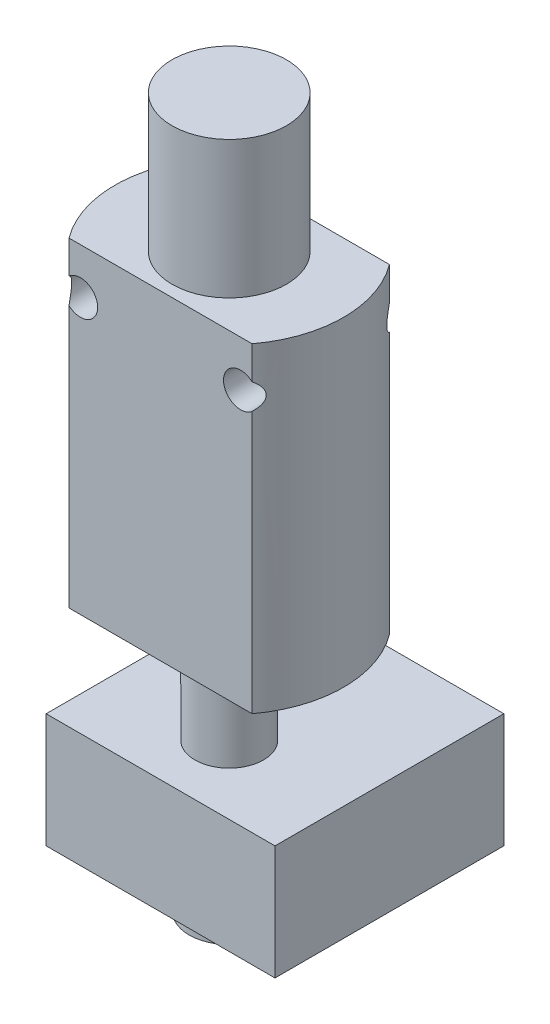
ISO-10303-21;
HEADER;
FILE_DESCRIPTION(('STEP AP214'),'2;1');
FILE_NAME('part.step','',(''),(''),'','','');
FILE_SCHEMA(('AUTOMOTIVE_DESIGN { 1 0 10303 214 1 1 1 1 }'));
ENDSEC;
DATA;
#1=APPLICATION_CONTEXT('core data for automotive mechanical design processes');
#2=APPLICATION_PROTOCOL_DEFINITION('international standard','automotive_design',2000,#1);
#3=PRODUCT_CONTEXT('',#1,'mechanical');
#4=PRODUCT('Part','Part','',(#3));
#5=PRODUCT_RELATED_PRODUCT_CATEGORY('part','',(#4));
#6=PRODUCT_DEFINITION_FORMATION('','',#4);
#7=PRODUCT_DEFINITION_CONTEXT('part definition',#1,'design');
#8=PRODUCT_DEFINITION('design','',#6,#7);
#9=PRODUCT_DEFINITION_SHAPE('','',#8);
#10=(LENGTH_UNIT() NAMED_UNIT(*) SI_UNIT(.MILLI.,.METRE.));
#11=(NAMED_UNIT(*) PLANE_ANGLE_UNIT() SI_UNIT($,.RADIAN.));
#12=(NAMED_UNIT(*) SI_UNIT($,.STERADIAN.) SOLID_ANGLE_UNIT());
#13=UNCERTAINTY_MEASURE_WITH_UNIT(LENGTH_MEASURE(1.E-05),#10,'distance_accuracy_value','');
#14=(GEOMETRIC_REPRESENTATION_CONTEXT(3) GLOBAL_UNCERTAINTY_ASSIGNED_CONTEXT((#13)) GLOBAL_UNIT_ASSIGNED_CONTEXT((#10,
#11,#12)) REPRESENTATION_CONTEXT('',''));
#15=CARTESIAN_POINT('',(0.,0.,0.));
#16=DIRECTION('',(0.,0.,1.));
#17=DIRECTION('',(1.,0.,0.));
#18=AXIS2_PLACEMENT_3D('',#15,#16,#17);
#19=CARTESIAN_POINT('',(-10.,14.,6.));
#20=DIRECTION('',(0.,-1.,0.));
#21=DIRECTION('',(0.,0.,-1.));
#22=AXIS2_PLACEMENT_3D('',#19,#20,#21);
#23=PLANE('',#22);
#24=CARTESIAN_POINT('',(0.,14.,0.));
#25=DIRECTION('',(0.,1.,0.));
#26=DIRECTION('',(0.,0.,1.));
#27=AXIS2_PLACEMENT_3D('',#24,#25,#26);
#28=CIRCLE('',#27,5.);
#29=CARTESIAN_POINT('',(0.,14.,5.));
#30=VERTEX_POINT('',#29);
#31=EDGE_CURVE('E144',#30,#30,#28,.T.);
#32=ORIENTED_EDGE('',*,*,#31,.F.);
#33=EDGE_LOOP('',(#32));
#34=FACE_BOUND('',#33,.T.);
#35=CARTESIAN_POINT('',(0.,14.,0.));
#36=DIRECTION('',(0.,1.,0.));
#37=DIRECTION('',(0.,0.,1.));
#38=AXIS2_PLACEMENT_3D('',#35,#36,#37);
#39=CIRCLE('',#38,9.99999999999999);
#40=CARTESIAN_POINT('',(-7.99999999999999,14.,-6.));
#41=VERTEX_POINT('',#40);
#42=CARTESIAN_POINT('',(-7.99999999999999,14.,6.));
#43=VERTEX_POINT('',#42);
#44=EDGE_CURVE('E121',#41,#43,#39,.T.);
#45=ORIENTED_EDGE('',*,*,#44,.T.);
#46=DIRECTION('',(-1.,0.,0.));
#47=VECTOR('',#46,1.);
#48=CARTESIAN_POINT('',(-10.,14.,6.));
#49=LINE('',#48,#47);
#50=CARTESIAN_POINT('',(7.99999999999999,14.,6.));
#51=VERTEX_POINT('',#50);
#52=EDGE_CURVE('E125',#51,#43,#49,.T.);
#53=ORIENTED_EDGE('',*,*,#52,.F.);
#54=CARTESIAN_POINT('',(0.,14.,0.));
#55=DIRECTION('',(0.,1.,0.));
#56=DIRECTION('',(0.,0.,1.));
#57=AXIS2_PLACEMENT_3D('',#54,#55,#56);
#58=CIRCLE('',#57,9.99999999999999);
#59=CARTESIAN_POINT('',(7.99999999999999,14.,-6.));
#60=VERTEX_POINT('',#59);
#61=EDGE_CURVE('E199',#51,#60,#58,.T.);
#62=ORIENTED_EDGE('',*,*,#61,.T.);
#63=DIRECTION('',(-1.,0.,0.));
#64=VECTOR('',#63,1.);
#65=CARTESIAN_POINT('',(-10.,14.,-6.));
#66=LINE('',#65,#64);
#67=EDGE_CURVE('E127',#60,#41,#66,.T.);
#68=ORIENTED_EDGE('',*,*,#67,.T.);
#69=EDGE_LOOP('',(#45,#53,#62,#68));
#70=FACE_BOUND('',#69,.T.);
#71=ADVANCED_FACE('F33',(#34,#70),#23,.F.);
#72=CARTESIAN_POINT('',(-10.,-14.,6.));
#73=DIRECTION('',(0.,1.,0.));
#74=DIRECTION('',(0.,0.,1.));
#75=AXIS2_PLACEMENT_3D('',#72,#73,#74);
#76=PLANE('',#75);
#77=CARTESIAN_POINT('',(0.,-14.,0.));
#78=DIRECTION('',(0.,1.,0.));
#79=DIRECTION('',(0.,0.,1.));
#80=AXIS2_PLACEMENT_3D('',#77,#78,#79);
#81=CIRCLE('',#80,3.);
#82=CARTESIAN_POINT('',(0.,-14.,3.));
#83=VERTEX_POINT('',#82);
#84=EDGE_CURVE('E223',#83,#83,#81,.T.);
#85=ORIENTED_EDGE('',*,*,#84,.T.);
#86=EDGE_LOOP('',(#85));
#87=FACE_BOUND('',#86,.T.);
#88=DIRECTION('',(1.,0.,0.));
#89=VECTOR('',#88,1.);
#90=CARTESIAN_POINT('',(-10.,-14.,6.));
#91=LINE('',#90,#89);
#92=CARTESIAN_POINT('',(-7.99999999999999,-14.,6.));
#93=VERTEX_POINT('',#92);
#94=CARTESIAN_POINT('',(7.99999999999999,-14.,6.));
#95=VERTEX_POINT('',#94);
#96=EDGE_CURVE('E140',#93,#95,#91,.T.);
#97=ORIENTED_EDGE('',*,*,#96,.F.);
#98=CARTESIAN_POINT('',(0.,-14.,0.));
#99=DIRECTION('',(0.,1.,0.));
#100=DIRECTION('',(0.,0.,1.));
#101=AXIS2_PLACEMENT_3D('',#98,#99,#100);
#102=CIRCLE('',#101,9.99999999999999);
#103=CARTESIAN_POINT('',(-7.99999999999999,-14.,-6.));
#104=VERTEX_POINT('',#103);
#105=EDGE_CURVE('E200',#93,#104,#102,.F.);
#106=ORIENTED_EDGE('',*,*,#105,.T.);
#107=DIRECTION('',(1.,0.,0.));
#108=VECTOR('',#107,1.);
#109=CARTESIAN_POINT('',(-10.,-14.,-6.));
#110=LINE('',#109,#108);
#111=CARTESIAN_POINT('',(7.99999999999999,-14.,-6.));
#112=VERTEX_POINT('',#111);
#113=EDGE_CURVE('E141',#104,#112,#110,.T.);
#114=ORIENTED_EDGE('',*,*,#113,.T.);
#115=CARTESIAN_POINT('',(0.,-14.,0.));
#116=DIRECTION('',(0.,1.,0.));
#117=DIRECTION('',(0.,0.,1.));
#118=AXIS2_PLACEMENT_3D('',#115,#116,#117);
#119=CIRCLE('',#118,9.99999999999999);
#120=EDGE_CURVE('E128',#112,#95,#119,.F.);
#121=ORIENTED_EDGE('',*,*,#120,.T.);
#122=EDGE_LOOP('',(#97,#106,#114,#121));
#123=FACE_BOUND('',#122,.T.);
#124=ADVANCED_FACE('F205',(#87,#123),#76,.F.);
#125=CARTESIAN_POINT('',(-7.,10.,6.));
#126=DIRECTION('',(0.,0.,-1.));
#127=DIRECTION('',(-1.,0.,0.));
#128=AXIS2_PLACEMENT_3D('',#125,#126,#127);
#129=CYLINDRICAL_SURFACE('',#128,1.5);
#130=CARTESIAN_POINT('',(-7.,10.,-6.));
#131=DIRECTION('',(0.,0.,1.));
#132=DIRECTION('',(1.,0.,0.));
#133=AXIS2_PLACEMENT_3D('',#130,#131,#132);
#134=CIRCLE('',#133,1.5);
#135=CARTESIAN_POINT('',(-7.99999999999999,8.8819660112501,-6.));
#136=VERTEX_POINT('',#135);
#137=CARTESIAN_POINT('',(-7.99999999999999,11.1180339887499,-6.));
#138=VERTEX_POINT('',#137);
#139=EDGE_CURVE('E149',#136,#138,#134,.T.);
#140=ORIENTED_EDGE('',*,*,#139,.F.);
#141=CARTESIAN_POINT('',(-7.99999999999999,8.8819660112501,-6.));
#142=CARTESIAN_POINT('',(-8.03319709795339,8.91168999587392,-5.95574757794856));
#143=CARTESIAN_POINT('',(-8.06547382531949,8.94319406453813,-5.91193650763562));
#144=CARTESIAN_POINT('',(-8.12806349588235,9.01024924885044,-5.82558234333872));
#145=CARTESIAN_POINT('',(-8.15836573250745,9.04581994379503,-5.78304674477553));
#146=CARTESIAN_POINT('',(-8.21709784680618,9.12192094350839,-5.6992959478821));
#147=CARTESIAN_POINT('',(-8.24548102185268,9.16253286471241,-5.65812137582313));
#148=CARTESIAN_POINT('',(-8.2991820476017,9.24853986586232,-5.57905460198178));
#149=CARTESIAN_POINT('',(-8.32450671243462,9.29392387521647,-5.54115515917385));
#150=CARTESIAN_POINT('',(-8.36858418886494,9.3842199558626,-5.47432222692192));
#151=CARTESIAN_POINT('',(-8.38776138312471,9.42852544710386,-5.44485872774962));
#152=CARTESIAN_POINT('',(-8.42243915145812,9.52134456248971,-5.39106107623512));
#153=CARTESIAN_POINT('',(-8.43795154621582,9.56984394823762,-5.36671046153633));
#154=CARTESIAN_POINT('',(-8.46460110637092,9.67174421117296,-5.32458104602582));
#155=CARTESIAN_POINT('',(-8.47567021392915,9.72520694015195,-5.30690470094116));
#156=CARTESIAN_POINT('',(-8.49194866496654,9.83520431252895,-5.28081977259772));
#157=CARTESIAN_POINT('',(-8.49716945739679,9.89173272601723,-5.27239308241005));
#158=CARTESIAN_POINT('',(-8.50081944583781,9.99819648261795,-5.26650508032341));
#159=CARTESIAN_POINT('',(-8.50004219971293,10.0480352597205,-5.26776248596406));
#160=CARTESIAN_POINT('',(-8.49363811880348,10.146587853215,-5.27808168264521));
#161=CARTESIAN_POINT('',(-8.48800735531078,10.1953007254282,-5.28714979610468));
#162=CARTESIAN_POINT('',(-8.47127513329529,10.2973459180014,-5.31392281268726));
#163=CARTESIAN_POINT('',(-8.45947758401049,10.3502693365455,-5.33272261032079));
#164=CARTESIAN_POINT('',(-8.43130597602798,10.4518344295103,-5.37715277375631));
#165=CARTESIAN_POINT('',(-8.41492382133668,10.5004683273753,-5.40279521929137));
#166=CARTESIAN_POINT('',(-8.36861987041464,10.6187450069766,-5.47438161937196));
#167=CARTESIAN_POINT('',(-8.33619690891963,10.6853035208725,-5.52375215997205));
#168=CARTESIAN_POINT('',(-8.26517248972191,10.8089780262943,-5.62947761030729));
#169=CARTESIAN_POINT('',(-8.22655015352859,10.8660607343773,-5.6858559711276));
#170=CARTESIAN_POINT('',(-8.15666561018673,10.9562121489143,-5.78544215884129));
#171=CARTESIAN_POINT('',(-8.12660113188093,10.9913924316923,-5.82761873016638));
#172=CARTESIAN_POINT('',(-8.06464717168066,11.0576149614166,-5.91305749310683));
#173=CARTESIAN_POINT('',(-8.0327762062478,11.0886910901623,-5.95630676548155));
#174=CARTESIAN_POINT('',(-8.,11.1180339887499,-6.));
#175=B_SPLINE_CURVE_WITH_KNOTS('',3,(#141,#142,#143,#144,#145,#146,#147,#148,#149,#150,#151,
#152,#153,#154,#155,#156,#157,#158,#159,#160,#161,#162,#163,#164,#165,#166,#167,#168,#169,#170,
#171,#172,#173,#174),.UNSPECIFIED.,.F.,.F.,(4,2,2,2,2,2,2,2,2,2,2,2,2,2,2,2,4),(0.,
0.188433784760338,0.377816388273991,0.570809072083472,0.76336352449458,0.932633231778437,
1.10134927478578,1.27255905579028,1.44343307910128,1.59212863584515,1.7409446682314,
1.9121689192985,2.08369746568321,2.34918211584102,2.6155803962468,2.80325566076793,
2.98926916684157),.UNSPECIFIED.);
#176=EDGE_CURVE('E40',#136,#138,#175,.T.);
#177=ORIENTED_EDGE('',*,*,#176,.T.);
#178=EDGE_LOOP('',(#140,#177));
#179=FACE_BOUND('',#178,.T.);
#180=CARTESIAN_POINT('',(-7.,10.,6.));
#181=DIRECTION('',(0.,0.,1.));
#182=DIRECTION('',(1.,0.,0.));
#183=AXIS2_PLACEMENT_3D('',#180,#181,#182);
#184=CIRCLE('',#183,1.5);
#185=CARTESIAN_POINT('',(-7.99999999999999,8.8819660112501,6.));
#186=VERTEX_POINT('',#185);
#187=CARTESIAN_POINT('',(-7.99999999999999,11.1180339887499,6.));
#188=VERTEX_POINT('',#187);
#189=EDGE_CURVE('E152',#186,#188,#184,.T.);
#190=ORIENTED_EDGE('',*,*,#189,.T.);
#191=CARTESIAN_POINT('',(-7.99999999999999,11.1180339887499,6.));
#192=CARTESIAN_POINT('',(-8.03319709795339,11.0883100041261,5.95574757794856));
#193=CARTESIAN_POINT('',(-8.06547382531949,11.0568059354619,5.91193650763562));
#194=CARTESIAN_POINT('',(-8.12806349588235,10.9897507511496,5.82558234333872));
#195=CARTESIAN_POINT('',(-8.15836573250745,10.954180056205,5.78304674477553));
#196=CARTESIAN_POINT('',(-8.21709784680617,10.8780790564916,5.6992959478821));
#197=CARTESIAN_POINT('',(-8.24548102185268,10.8374671352876,5.65812137582313));
#198=CARTESIAN_POINT('',(-8.2991820476017,10.7514601341377,5.57905460198178));
#199=CARTESIAN_POINT('',(-8.32450671243462,10.7060761247835,5.54115515917385));
#200=CARTESIAN_POINT('',(-8.36858418886494,10.6157800441374,5.47432222692192));
#201=CARTESIAN_POINT('',(-8.38776138312471,10.5714745528961,5.44485872774962));
#202=CARTESIAN_POINT('',(-8.42243915145812,10.4786554375103,5.39106107623512));
#203=CARTESIAN_POINT('',(-8.43795154621582,10.4301560517624,5.36671046153633));
#204=CARTESIAN_POINT('',(-8.46460110637092,10.328255788827,5.32458104602582));
#205=CARTESIAN_POINT('',(-8.47567021392915,10.274793059848,5.30690470094116));
#206=CARTESIAN_POINT('',(-8.49194866496654,10.164795687471,5.28081977259772));
#207=CARTESIAN_POINT('',(-8.49716945739679,10.1082672739828,5.27239308241005));
#208=CARTESIAN_POINT('',(-8.50081944583781,10.001803517382,5.26650508032341));
#209=CARTESIAN_POINT('',(-8.50004219971293,9.95196474027946,5.26776248596406));
#210=CARTESIAN_POINT('',(-8.49363811880348,9.85341214678495,5.27808168264521));
#211=CARTESIAN_POINT('',(-8.48800735531078,9.80469927457184,5.28714979610468));
#212=CARTESIAN_POINT('',(-8.47127513329529,9.70265408199865,5.31392281268726));
#213=CARTESIAN_POINT('',(-8.45947758401049,9.64973066345448,5.33272261032079));
#214=CARTESIAN_POINT('',(-8.43130597602798,9.54816557048967,5.37715277375631));
#215=CARTESIAN_POINT('',(-8.41492382133668,9.49953167262469,5.40279521929137));
#216=CARTESIAN_POINT('',(-8.36861987041464,9.38125499302338,5.47438161937196));
#217=CARTESIAN_POINT('',(-8.33619690891963,9.31469647912746,5.52375215997205));
#218=CARTESIAN_POINT('',(-8.26517248972191,9.1910219737057,5.62947761030729));
#219=CARTESIAN_POINT('',(-8.22655015352859,9.13393926562267,5.6858559711276));
#220=CARTESIAN_POINT('',(-8.15666561018673,9.04378785108572,5.78544215884129));
#221=CARTESIAN_POINT('',(-8.12660113188093,9.00860756830766,5.82761873016638));
#222=CARTESIAN_POINT('',(-8.06464717168066,8.94238503858345,5.91305749310683));
#223=CARTESIAN_POINT('',(-8.0327762062478,8.9113089098377,5.95630676548154));
#224=CARTESIAN_POINT('',(-8.,8.8819660112501,6.));
#225=B_SPLINE_CURVE_WITH_KNOTS('',3,(#191,#192,#193,#194,#195,#196,#197,#198,#199,#200,#201,
#202,#203,#204,#205,#206,#207,#208,#209,#210,#211,#212,#213,#214,#215,#216,#217,#218,#219,#220,
#221,#222,#223,#224),.UNSPECIFIED.,.F.,.F.,(4,2,2,2,2,2,2,2,2,2,2,2,2,2,2,2,4),(0.,
0.188433784760338,0.377816388273991,0.570809072083472,0.76336352449458,0.932633231778437,
1.10134927478578,1.27255905579028,1.44343307910128,1.59212863584515,1.7409446682314,
1.9121689192985,2.08369746568321,2.34918211584102,2.6155803962468,2.80325566076793,
2.98926916684157),.UNSPECIFIED.);
#226=EDGE_CURVE('E132',#188,#186,#225,.T.);
#227=ORIENTED_EDGE('',*,*,#226,.T.);
#228=EDGE_LOOP('',(#190,#227));
#229=FACE_BOUND('',#228,.T.);
#230=ADVANCED_FACE('F201',(#179,#229),#129,.F.);
#231=CARTESIAN_POINT('',(7.,10.,6.));
#232=DIRECTION('',(0.,0.,-1.));
#233=DIRECTION('',(-1.,0.,0.));
#234=AXIS2_PLACEMENT_3D('',#231,#232,#233);
#235=CYLINDRICAL_SURFACE('',#234,1.5);
#236=CARTESIAN_POINT('',(7.,10.,-6.));
#237=DIRECTION('',(0.,0.,1.));
#238=DIRECTION('',(-1.,0.,0.));
#239=AXIS2_PLACEMENT_3D('',#236,#237,#238);
#240=CIRCLE('',#239,1.5);
#241=CARTESIAN_POINT('',(7.99999999999999,11.1180339887499,-6.));
#242=VERTEX_POINT('',#241);
#243=CARTESIAN_POINT('',(7.99999999999999,8.8819660112501,-6.));
#244=VERTEX_POINT('',#243);
#245=EDGE_CURVE('E235',#242,#244,#240,.T.);
#246=ORIENTED_EDGE('',*,*,#245,.F.);
#247=CARTESIAN_POINT('',(7.99999999999999,11.1180339887499,-6.));
#248=CARTESIAN_POINT('',(8.03319709795339,11.0883100041261,-5.95574757794856));
#249=CARTESIAN_POINT('',(8.06547382531949,11.0568059354619,-5.91193650763563));
#250=CARTESIAN_POINT('',(8.12806349588235,10.9897507511496,-5.82558234333872));
#251=CARTESIAN_POINT('',(8.15836573250745,10.954180056205,-5.78304674477553));
#252=CARTESIAN_POINT('',(8.21709784680618,10.8780790564916,-5.69929594788209));
#253=CARTESIAN_POINT('',(8.24548102185268,10.8374671352876,-5.65812137582313));
#254=CARTESIAN_POINT('',(8.2991820476017,10.7514601341377,-5.57905460198178));
#255=CARTESIAN_POINT('',(8.32450671243462,10.7060761247835,-5.54115515917385));
#256=CARTESIAN_POINT('',(8.36858418886494,10.6157800441374,-5.47432222692192));
#257=CARTESIAN_POINT('',(8.38776138312471,10.5714745528961,-5.44485872774962));
#258=CARTESIAN_POINT('',(8.42243915145811,10.4786554375103,-5.39106107623512));
#259=CARTESIAN_POINT('',(8.43795154621582,10.4301560517624,-5.36671046153633));
#260=CARTESIAN_POINT('',(8.46460110637092,10.328255788827,-5.32458104602582));
#261=CARTESIAN_POINT('',(8.47567021392915,10.274793059848,-5.30690470094116));
#262=CARTESIAN_POINT('',(8.49194866496654,10.164795687471,-5.28081977259772));
#263=CARTESIAN_POINT('',(8.49716945739679,10.1082672739828,-5.27239308241005));
#264=CARTESIAN_POINT('',(8.50081944583781,10.001803517382,-5.26650508032341));
#265=CARTESIAN_POINT('',(8.50004219971293,9.95196474027946,-5.26776248596406));
#266=CARTESIAN_POINT('',(8.49363811880348,9.85341214678495,-5.27808168264521));
#267=CARTESIAN_POINT('',(8.48800735531078,9.80469927457184,-5.28714979610468));
#268=CARTESIAN_POINT('',(8.47127513329529,9.70265408199865,-5.31392281268726));
#269=CARTESIAN_POINT('',(8.45947758401049,9.64973066345448,-5.33272261032079));
#270=CARTESIAN_POINT('',(8.43130597602798,9.54816557048968,-5.37715277375631));
#271=CARTESIAN_POINT('',(8.41492382133668,9.49953167262469,-5.40279521929137));
#272=CARTESIAN_POINT('',(8.36861987041464,9.38125499302338,-5.47438161937196));
#273=CARTESIAN_POINT('',(8.33619690891963,9.31469647912746,-5.52375215997205));
#274=CARTESIAN_POINT('',(8.26517248972191,9.1910219737057,-5.62947761030729));
#275=CARTESIAN_POINT('',(8.22655015352859,9.13393926562267,-5.6858559711276));
#276=CARTESIAN_POINT('',(8.15666561018673,9.04378785108572,-5.78544215884129));
#277=CARTESIAN_POINT('',(8.12660113188092,9.00860756830766,-5.82761873016638));
#278=CARTESIAN_POINT('',(8.06464717168066,8.94238503858345,-5.91305749310683));
#279=CARTESIAN_POINT('',(8.03277620624779,8.9113089098377,-5.95630676548155));
#280=CARTESIAN_POINT('',(7.99999999999999,8.8819660112501,-6.));
#281=B_SPLINE_CURVE_WITH_KNOTS('',3,(#247,#248,#249,#250,#251,#252,#253,#254,#255,#256,#257,
#258,#259,#260,#261,#262,#263,#264,#265,#266,#267,#268,#269,#270,#271,#272,#273,#274,#275,#276,
#277,#278,#279,#280),.UNSPECIFIED.,.F.,.F.,(4,2,2,2,2,2,2,2,2,2,2,2,2,2,2,2,4),(0.,
0.188433784760337,0.377816388273991,0.570809072083475,0.763363524494579,0.932633231778435,
1.10134927478578,1.27255905579028,1.44343307910128,1.59212863584514,1.7409446682314,
1.91216891929849,2.08369746568321,2.34918211584102,2.6155803962468,2.80325566076793,
2.98926916684157),.UNSPECIFIED.);
#282=EDGE_CURVE('E157',#242,#244,#281,.T.);
#283=ORIENTED_EDGE('',*,*,#282,.T.);
#284=EDGE_LOOP('',(#246,#283));
#285=FACE_BOUND('',#284,.T.);
#286=CARTESIAN_POINT('',(7.,10.,6.));
#287=DIRECTION('',(0.,0.,1.));
#288=DIRECTION('',(-1.,0.,0.));
#289=AXIS2_PLACEMENT_3D('',#286,#287,#288);
#290=CIRCLE('',#289,1.5);
#291=CARTESIAN_POINT('',(7.99999999999999,11.1180339887499,6.));
#292=VERTEX_POINT('',#291);
#293=CARTESIAN_POINT('',(7.99999999999999,8.8819660112501,6.));
#294=VERTEX_POINT('',#293);
#295=EDGE_CURVE('E233',#292,#294,#290,.T.);
#296=ORIENTED_EDGE('',*,*,#295,.T.);
#297=CARTESIAN_POINT('',(7.99999999999999,8.8819660112501,6.));
#298=CARTESIAN_POINT('',(8.03319709795339,8.91168999587392,5.95574757794856));
#299=CARTESIAN_POINT('',(8.06547382531949,8.94319406453813,5.91193650763563));
#300=CARTESIAN_POINT('',(8.12806349588235,9.01024924885044,5.82558234333872));
#301=CARTESIAN_POINT('',(8.15836573250745,9.04581994379503,5.78304674477553));
#302=CARTESIAN_POINT('',(8.21709784680618,9.12192094350839,5.69929594788209));
#303=CARTESIAN_POINT('',(8.24548102185268,9.16253286471241,5.65812137582313));
#304=CARTESIAN_POINT('',(8.2991820476017,9.24853986586232,5.57905460198178));
#305=CARTESIAN_POINT('',(8.32450671243462,9.29392387521647,5.54115515917385));
#306=CARTESIAN_POINT('',(8.36858418886494,9.3842199558626,5.47432222692192));
#307=CARTESIAN_POINT('',(8.38776138312471,9.42852544710387,5.44485872774962));
#308=CARTESIAN_POINT('',(8.42243915145811,9.52134456248971,5.39106107623512));
#309=CARTESIAN_POINT('',(8.43795154621582,9.56984394823762,5.36671046153633));
#310=CARTESIAN_POINT('',(8.46460110637092,9.67174421117296,5.32458104602582));
#311=CARTESIAN_POINT('',(8.47567021392915,9.72520694015195,5.30690470094116));
#312=CARTESIAN_POINT('',(8.49194866496654,9.83520431252895,5.28081977259772));
#313=CARTESIAN_POINT('',(8.49716945739679,9.89173272601723,5.27239308241005));
#314=CARTESIAN_POINT('',(8.50081944583781,9.99819648261795,5.26650508032341));
#315=CARTESIAN_POINT('',(8.50004219971293,10.0480352597205,5.26776248596406));
#316=CARTESIAN_POINT('',(8.49363811880348,10.146587853215,5.27808168264521));
#317=CARTESIAN_POINT('',(8.48800735531078,10.1953007254282,5.28714979610468));
#318=CARTESIAN_POINT('',(8.47127513329529,10.2973459180014,5.31392281268726));
#319=CARTESIAN_POINT('',(8.45947758401049,10.3502693365455,5.33272261032079));
#320=CARTESIAN_POINT('',(8.43130597602798,10.4518344295103,5.37715277375631));
#321=CARTESIAN_POINT('',(8.41492382133668,10.5004683273753,5.40279521929137));
#322=CARTESIAN_POINT('',(8.36861987041464,10.6187450069766,5.47438161937196));
#323=CARTESIAN_POINT('',(8.33619690891963,10.6853035208725,5.52375215997205));
#324=CARTESIAN_POINT('',(8.26517248972191,10.8089780262943,5.62947761030729));
#325=CARTESIAN_POINT('',(8.22655015352859,10.8660607343773,5.6858559711276));
#326=CARTESIAN_POINT('',(8.15666561018673,10.9562121489143,5.78544215884129));
#327=CARTESIAN_POINT('',(8.12660113188092,10.9913924316923,5.82761873016639));
#328=CARTESIAN_POINT('',(8.06464717168066,11.0576149614166,5.91305749310683));
#329=CARTESIAN_POINT('',(8.03277620624779,11.0886910901623,5.95630676548155));
#330=CARTESIAN_POINT('',(7.99999999999999,11.1180339887499,6.));
#331=B_SPLINE_CURVE_WITH_KNOTS('',3,(#297,#298,#299,#300,#301,#302,#303,#304,#305,#306,#307,
#308,#309,#310,#311,#312,#313,#314,#315,#316,#317,#318,#319,#320,#321,#322,#323,#324,#325,#326,
#327,#328,#329,#330),.UNSPECIFIED.,.F.,.F.,(4,2,2,2,2,2,2,2,2,2,2,2,2,2,2,2,4),(0.,
0.188433784760337,0.377816388273991,0.570809072083475,0.763363524494579,0.932633231778435,
1.10134927478578,1.27255905579028,1.44343307910128,1.59212863584514,1.7409446682314,
1.91216891929849,2.0836974656832,2.34918211584102,2.6155803962468,2.80325566076794,
2.98926916684157),.UNSPECIFIED.);
#332=EDGE_CURVE('E183',#294,#292,#331,.T.);
#333=ORIENTED_EDGE('',*,*,#332,.T.);
#334=EDGE_LOOP('',(#296,#333));
#335=FACE_BOUND('',#334,.T.);
#336=ADVANCED_FACE('F170',(#285,#335),#235,.F.);
#337=CARTESIAN_POINT('',(0.,0.,6.));
#338=DIRECTION('',(0.,0.,1.));
#339=DIRECTION('',(1.,0.,0.));
#340=AXIS2_PLACEMENT_3D('',#337,#338,#339);
#341=PLANE('',#340);
#342=ORIENTED_EDGE('',*,*,#52,.T.);
#343=DIRECTION('',(0.,1.,0.));
#344=VECTOR('',#343,1.);
#345=CARTESIAN_POINT('',(-7.99999999999999,-20.3245553203368,6.));
#346=LINE('',#345,#344);
#347=EDGE_CURVE('E11',#43,#188,#346,.F.);
#348=ORIENTED_EDGE('',*,*,#347,.T.);
#349=ORIENTED_EDGE('',*,*,#189,.F.);
#350=DIRECTION('',(0.,1.,0.));
#351=VECTOR('',#350,1.);
#352=CARTESIAN_POINT('',(-7.99999999999999,-20.3245553203368,6.));
#353=LINE('',#352,#351);
#354=EDGE_CURVE('E191',#93,#186,#353,.T.);
#355=ORIENTED_EDGE('',*,*,#354,.F.);
#356=ORIENTED_EDGE('',*,*,#96,.T.);
#357=DIRECTION('',(0.,1.,0.));
#358=VECTOR('',#357,1.);
#359=CARTESIAN_POINT('',(7.99999999999999,-20.3245553203368,6.));
#360=LINE('',#359,#358);
#361=EDGE_CURVE('E192',#95,#294,#360,.T.);
#362=ORIENTED_EDGE('',*,*,#361,.T.);
#363=ORIENTED_EDGE('',*,*,#295,.F.);
#364=EDGE_CURVE('E139',#292,#51,#360,.T.);
#365=ORIENTED_EDGE('',*,*,#364,.T.);
#366=EDGE_LOOP('',(#342,#348,#349,#355,#356,#362,#363,#365));
#367=FACE_BOUND('',#366,.T.);
#368=ADVANCED_FACE('F137',(#367),#341,.T.);
#369=CARTESIAN_POINT('',(0.,0.,-6.));
#370=DIRECTION('',(0.,0.,1.));
#371=DIRECTION('',(1.,0.,0.));
#372=AXIS2_PLACEMENT_3D('',#369,#370,#371);
#373=PLANE('',#372);
#374=DIRECTION('',(0.,1.,0.));
#375=VECTOR('',#374,1.);
#376=CARTESIAN_POINT('',(-7.99999999999999,-20.3245553203368,-6.));
#377=LINE('',#376,#375);
#378=EDGE_CURVE('E47',#138,#41,#377,.T.);
#379=ORIENTED_EDGE('',*,*,#378,.T.);
#380=ORIENTED_EDGE('',*,*,#67,.F.);
#381=DIRECTION('',(0.,1.,0.));
#382=VECTOR('',#381,1.);
#383=CARTESIAN_POINT('',(7.99999999999999,-20.3245553203368,-6.));
#384=LINE('',#383,#382);
#385=EDGE_CURVE('E287',#242,#60,#384,.T.);
#386=ORIENTED_EDGE('',*,*,#385,.F.);
#387=ORIENTED_EDGE('',*,*,#245,.T.);
#388=EDGE_CURVE('E55',#112,#244,#384,.T.);
#389=ORIENTED_EDGE('',*,*,#388,.F.);
#390=ORIENTED_EDGE('',*,*,#113,.F.);
#391=EDGE_CURVE('E290',#104,#136,#377,.T.);
#392=ORIENTED_EDGE('',*,*,#391,.T.);
#393=ORIENTED_EDGE('',*,*,#139,.T.);
#394=EDGE_LOOP('',(#379,#380,#386,#387,#389,#390,#392,#393));
#395=FACE_BOUND('',#394,.T.);
#396=ADVANCED_FACE('F210',(#395),#373,.F.);
#397=CARTESIAN_POINT('',(0.,0.,0.));
#398=DIRECTION('',(0.,1.,0.));
#399=DIRECTION('',(0.,0.,1.));
#400=AXIS2_PLACEMENT_3D('',#397,#398,#399);
#401=CYLINDRICAL_SURFACE('',#400,3.);
#402=ORIENTED_EDGE('',*,*,#84,.F.);
#403=EDGE_LOOP('',(#402));
#404=FACE_BOUND('',#403,.T.);
#405=CARTESIAN_POINT('',(0.,-23.,0.));
#406=DIRECTION('',(0.,-1.,0.));
#407=DIRECTION('',(0.,0.,-1.));
#408=AXIS2_PLACEMENT_3D('',#405,#406,#407);
#409=CIRCLE('',#408,3.);
#410=CARTESIAN_POINT('',(0.,-23.,-3.));
#411=VERTEX_POINT('',#410);
#412=EDGE_CURVE('E154',#411,#411,#409,.T.);
#413=ORIENTED_EDGE('',*,*,#412,.F.);
#414=EDGE_LOOP('',(#413));
#415=FACE_BOUND('',#414,.T.);
#416=ADVANCED_FACE('F212',(#404,#415),#401,.T.);
#417=CARTESIAN_POINT('',(0.,26.,0.));
#418=DIRECTION('',(0.,-1.,0.));
#419=DIRECTION('',(0.,0.,-1.));
#420=AXIS2_PLACEMENT_3D('',#417,#418,#419);
#421=PLANE('',#420);
#422=CARTESIAN_POINT('',(0.,26.,0.));
#423=DIRECTION('',(0.,1.,0.));
#424=DIRECTION('',(0.,0.,1.));
#425=AXIS2_PLACEMENT_3D('',#422,#423,#424);
#426=CIRCLE('',#425,5.);
#427=CARTESIAN_POINT('',(0.,26.,5.));
#428=VERTEX_POINT('',#427);
#429=EDGE_CURVE('E249',#428,#428,#426,.T.);
#430=ORIENTED_EDGE('',*,*,#429,.T.);
#431=EDGE_LOOP('',(#430));
#432=FACE_BOUND('',#431,.T.);
#433=ADVANCED_FACE('F317',(#432),#421,.F.);
#434=CARTESIAN_POINT('',(0.,0.,0.));
#435=DIRECTION('',(0.,1.,0.));
#436=DIRECTION('',(0.,0.,1.));
#437=AXIS2_PLACEMENT_3D('',#434,#435,#436);
#438=CYLINDRICAL_SURFACE('',#437,5.);
#439=ORIENTED_EDGE('',*,*,#429,.F.);
#440=EDGE_LOOP('',(#439));
#441=FACE_BOUND('',#440,.T.);
#442=ORIENTED_EDGE('',*,*,#31,.T.);
#443=EDGE_LOOP('',(#442));
#444=FACE_BOUND('',#443,.T.);
#445=ADVANCED_FACE('F327',(#441,#444),#438,.T.);
#446=CARTESIAN_POINT('',(-10.,-23.,0.));
#447=DIRECTION('',(-1.,0.,0.));
#448=DIRECTION('',(0.,0.,1.));
#449=AXIS2_PLACEMENT_3D('',#446,#447,#448);
#450=PLANE('',#449);
#451=DIRECTION('',(0.,0.,-1.));
#452=VECTOR('',#451,1.);
#453=CARTESIAN_POINT('',(-10.,-33.,0.));
#454=LINE('',#453,#452);
#455=CARTESIAN_POINT('',(-10.,-33.,6.));
#456=VERTEX_POINT('',#455);
#457=CARTESIAN_POINT('',(-10.,-33.,-14.));
#458=VERTEX_POINT('',#457);
#459=EDGE_CURVE('E273',#456,#458,#454,.T.);
#460=ORIENTED_EDGE('',*,*,#459,.F.);
#461=DIRECTION('',(0.,-1.,0.));
#462=VECTOR('',#461,1.);
#463=CARTESIAN_POINT('',(-10.,-23.,6.));
#464=LINE('',#463,#462);
#465=CARTESIAN_POINT('',(-10.,-23.,6.));
#466=VERTEX_POINT('',#465);
#467=EDGE_CURVE('E252',#466,#456,#464,.T.);
#468=ORIENTED_EDGE('',*,*,#467,.F.);
#469=DIRECTION('',(0.,0.,-1.));
#470=VECTOR('',#469,1.);
#471=CARTESIAN_POINT('',(-10.,-23.,0.));
#472=LINE('',#471,#470);
#473=CARTESIAN_POINT('',(-10.,-23.,-14.));
#474=VERTEX_POINT('',#473);
#475=EDGE_CURVE('E266',#466,#474,#472,.T.);
#476=ORIENTED_EDGE('',*,*,#475,.T.);
#477=DIRECTION('',(0.,-1.,0.));
#478=VECTOR('',#477,1.);
#479=CARTESIAN_POINT('',(-10.,-23.,-14.));
#480=LINE('',#479,#478);
#481=EDGE_CURVE('E255',#474,#458,#480,.T.);
#482=ORIENTED_EDGE('',*,*,#481,.T.);
#483=EDGE_LOOP('',(#460,#468,#476,#482));
#484=FACE_BOUND('',#483,.T.);
#485=ADVANCED_FACE('F335',(#484),#450,.T.);
#486=CARTESIAN_POINT('',(3.,-23.,6.));
#487=DIRECTION('',(0.,0.,1.));
#488=DIRECTION('',(1.,0.,0.));
#489=AXIS2_PLACEMENT_3D('',#486,#487,#488);
#490=PLANE('',#489);
#491=DIRECTION('',(-1.,0.,0.));
#492=VECTOR('',#491,1.);
#493=CARTESIAN_POINT('',(3.,-33.,6.));
#494=LINE('',#493,#492);
#495=CARTESIAN_POINT('',(10.,-33.,6.));
#496=VERTEX_POINT('',#495);
#497=EDGE_CURVE('E263',#496,#456,#494,.T.);
#498=ORIENTED_EDGE('',*,*,#497,.F.);
#499=DIRECTION('',(0.,-1.,0.));
#500=VECTOR('',#499,1.);
#501=CARTESIAN_POINT('',(10.,-23.,6.));
#502=LINE('',#501,#500);
#503=CARTESIAN_POINT('',(10.,-23.,6.));
#504=VERTEX_POINT('',#503);
#505=EDGE_CURVE('E260',#504,#496,#502,.T.);
#506=ORIENTED_EDGE('',*,*,#505,.F.);
#507=DIRECTION('',(-1.,0.,0.));
#508=VECTOR('',#507,1.);
#509=CARTESIAN_POINT('',(3.,-23.,6.));
#510=LINE('',#509,#508);
#511=EDGE_CURVE('E258',#504,#466,#510,.T.);
#512=ORIENTED_EDGE('',*,*,#511,.T.);
#513=ORIENTED_EDGE('',*,*,#467,.T.);
#514=EDGE_LOOP('',(#498,#506,#512,#513));
#515=FACE_BOUND('',#514,.T.);
#516=ADVANCED_FACE('F342',(#515),#490,.T.);
#517=CARTESIAN_POINT('',(10.,-23.,0.));
#518=DIRECTION('',(1.,0.,0.));
#519=DIRECTION('',(0.,0.,-1.));
#520=AXIS2_PLACEMENT_3D('',#517,#518,#519);
#521=PLANE('',#520);
#522=DIRECTION('',(0.,0.,1.));
#523=VECTOR('',#522,1.);
#524=CARTESIAN_POINT('',(10.,-33.,0.));
#525=LINE('',#524,#523);
#526=CARTESIAN_POINT('',(10.,-33.,-14.));
#527=VERTEX_POINT('',#526);
#528=EDGE_CURVE('E267',#527,#496,#525,.T.);
#529=ORIENTED_EDGE('',*,*,#528,.F.);
#530=DIRECTION('',(0.,-1.,0.));
#531=VECTOR('',#530,1.);
#532=CARTESIAN_POINT('',(10.,-23.,-14.));
#533=LINE('',#532,#531);
#534=CARTESIAN_POINT('',(10.,-23.,-14.));
#535=VERTEX_POINT('',#534);
#536=EDGE_CURVE('E257',#535,#527,#533,.T.);
#537=ORIENTED_EDGE('',*,*,#536,.F.);
#538=DIRECTION('',(0.,0.,1.));
#539=VECTOR('',#538,1.);
#540=CARTESIAN_POINT('',(10.,-23.,0.));
#541=LINE('',#540,#539);
#542=EDGE_CURVE('E278',#535,#504,#541,.T.);
#543=ORIENTED_EDGE('',*,*,#542,.T.);
#544=ORIENTED_EDGE('',*,*,#505,.T.);
#545=EDGE_LOOP('',(#529,#537,#543,#544));
#546=FACE_BOUND('',#545,.T.);
#547=ADVANCED_FACE('F350',(#546),#521,.T.);
#548=CARTESIAN_POINT('',(3.,-23.,-14.));
#549=DIRECTION('',(0.,0.,-1.));
#550=DIRECTION('',(-1.,0.,0.));
#551=AXIS2_PLACEMENT_3D('',#548,#549,#550);
#552=PLANE('',#551);
#553=DIRECTION('',(1.,0.,0.));
#554=VECTOR('',#553,1.);
#555=CARTESIAN_POINT('',(3.,-33.,-14.));
#556=LINE('',#555,#554);
#557=EDGE_CURVE('E270',#458,#527,#556,.T.);
#558=ORIENTED_EDGE('',*,*,#557,.F.);
#559=ORIENTED_EDGE('',*,*,#481,.F.);
#560=DIRECTION('',(1.,0.,0.));
#561=VECTOR('',#560,1.);
#562=CARTESIAN_POINT('',(3.,-23.,-14.));
#563=LINE('',#562,#561);
#564=EDGE_CURVE('E281',#474,#535,#563,.T.);
#565=ORIENTED_EDGE('',*,*,#564,.T.);
#566=ORIENTED_EDGE('',*,*,#536,.T.);
#567=EDGE_LOOP('',(#558,#559,#565,#566));
#568=FACE_BOUND('',#567,.T.);
#569=ADVANCED_FACE('F358',(#568),#552,.T.);
#570=CARTESIAN_POINT('',(0.,-23.,0.));
#571=DIRECTION('',(0.,-1.,0.));
#572=DIRECTION('',(0.,0.,-1.));
#573=AXIS2_PLACEMENT_3D('',#570,#571,#572);
#574=PLANE('',#573);
#575=ORIENTED_EDGE('',*,*,#412,.T.);
#576=EDGE_LOOP('',(#575));
#577=FACE_BOUND('',#576,.T.);
#578=ORIENTED_EDGE('',*,*,#475,.F.);
#579=ORIENTED_EDGE('',*,*,#511,.F.);
#580=ORIENTED_EDGE('',*,*,#542,.F.);
#581=ORIENTED_EDGE('',*,*,#564,.F.);
#582=EDGE_LOOP('',(#578,#579,#580,#581));
#583=FACE_BOUND('',#582,.T.);
#584=ADVANCED_FACE('F179',(#577,#583),#574,.F.);
#585=CARTESIAN_POINT('',(0.,-33.,0.));
#586=DIRECTION('',(0.,-1.,0.));
#587=DIRECTION('',(0.,0.,-1.));
#588=AXIS2_PLACEMENT_3D('',#585,#586,#587);
#589=PLANE('',#588);
#590=CARTESIAN_POINT('',(0.,-33.,0.));
#591=DIRECTION('',(0.,1.,0.));
#592=DIRECTION('',(0.,0.,1.));
#593=AXIS2_PLACEMENT_3D('',#590,#591,#592);
#594=CIRCLE('',#593,3.5);
#595=CARTESIAN_POINT('',(0.,-33.,3.5));
#596=VERTEX_POINT('',#595);
#597=EDGE_CURVE('E245',#596,#596,#594,.T.);
#598=ORIENTED_EDGE('',*,*,#597,.T.);
#599=EDGE_LOOP('',(#598));
#600=FACE_BOUND('',#599,.T.);
#601=ORIENTED_EDGE('',*,*,#459,.T.);
#602=ORIENTED_EDGE('',*,*,#557,.T.);
#603=ORIENTED_EDGE('',*,*,#528,.T.);
#604=ORIENTED_EDGE('',*,*,#497,.T.);
#605=EDGE_LOOP('',(#601,#602,#603,#604));
#606=FACE_BOUND('',#605,.T.);
#607=ADVANCED_FACE('F373',(#600,#606),#589,.T.);
#608=CARTESIAN_POINT('',(0.750000000000005,-38.,0.));
#609=DIRECTION('',(0.,1.,0.));
#610=DIRECTION('',(0.,0.,1.));
#611=AXIS2_PLACEMENT_3D('',#608,#609,#610);
#612=PLANE('',#611);
#613=CARTESIAN_POINT('',(0.,-38.,0.));
#614=DIRECTION('',(0.,1.,0.));
#615=DIRECTION('',(0.,0.,1.));
#616=AXIS2_PLACEMENT_3D('',#613,#614,#615);
#617=CIRCLE('',#616,0.750000000000005);
#618=CARTESIAN_POINT('',(0.,-38.,0.750000000000005));
#619=VERTEX_POINT('',#618);
#620=EDGE_CURVE('E238',#619,#619,#617,.T.);
#621=ORIENTED_EDGE('',*,*,#620,.F.);
#622=EDGE_LOOP('',(#621));
#623=FACE_BOUND('',#622,.T.);
#624=ADVANCED_FACE('F380',(#623),#612,.F.);
#625=CARTESIAN_POINT('',(0.,-38.,0.));
#626=DIRECTION('',(0.,1.,0.));
#627=DIRECTION('',(0.,0.,1.));
#628=AXIS2_PLACEMENT_3D('',#625,#626,#627);
#629=CONICAL_SURFACE('',#628,0.750000000000005,0.942000040379465);
#630=CARTESIAN_POINT('',(0.,-36.,0.));
#631=DIRECTION('',(0.,1.,0.));
#632=DIRECTION('',(0.,0.,1.));
#633=AXIS2_PLACEMENT_3D('',#630,#631,#632);
#634=CIRCLE('',#633,3.5);
#635=CARTESIAN_POINT('',(0.,-36.,3.5));
#636=VERTEX_POINT('',#635);
#637=EDGE_CURVE('E242',#636,#636,#634,.T.);
#638=ORIENTED_EDGE('',*,*,#637,.F.);
#639=EDGE_LOOP('',(#638));
#640=FACE_BOUND('',#639,.T.);
#641=ORIENTED_EDGE('',*,*,#620,.T.);
#642=EDGE_LOOP('',(#641));
#643=FACE_BOUND('',#642,.T.);
#644=ADVANCED_FACE('F388',(#640,#643),#629,.T.);
#645=CARTESIAN_POINT('',(0.,0.,0.));
#646=DIRECTION('',(0.,1.,0.));
#647=DIRECTION('',(0.,0.,1.));
#648=AXIS2_PLACEMENT_3D('',#645,#646,#647);
#649=CYLINDRICAL_SURFACE('',#648,3.5);
#650=ORIENTED_EDGE('',*,*,#597,.F.);
#651=EDGE_LOOP('',(#650));
#652=FACE_BOUND('',#651,.T.);
#653=ORIENTED_EDGE('',*,*,#637,.T.);
#654=EDGE_LOOP('',(#653));
#655=FACE_BOUND('',#654,.T.);
#656=ADVANCED_FACE('F177',(#652,#655),#649,.T.);
#657=CARTESIAN_POINT('',(0.,-20.3245553203368,0.));
#658=DIRECTION('',(0.,1.,0.));
#659=DIRECTION('',(0.,0.,1.));
#660=AXIS2_PLACEMENT_3D('',#657,#658,#659);
#661=CYLINDRICAL_SURFACE('',#660,9.99999999999999);
#662=ORIENTED_EDGE('',*,*,#385,.T.);
#663=ORIENTED_EDGE('',*,*,#61,.F.);
#664=ORIENTED_EDGE('',*,*,#364,.F.);
#665=ORIENTED_EDGE('',*,*,#332,.F.);
#666=ORIENTED_EDGE('',*,*,#361,.F.);
#667=ORIENTED_EDGE('',*,*,#120,.F.);
#668=ORIENTED_EDGE('',*,*,#388,.T.);
#669=ORIENTED_EDGE('',*,*,#282,.F.);
#670=EDGE_LOOP('',(#662,#663,#664,#665,#666,#667,#668,#669));
#671=FACE_BOUND('',#670,.T.);
#672=ADVANCED_FACE('F173',(#671),#661,.T.);
#673=CARTESIAN_POINT('',(0.,-20.3245553203368,0.));
#674=DIRECTION('',(0.,1.,0.));
#675=DIRECTION('',(0.,0.,1.));
#676=AXIS2_PLACEMENT_3D('',#673,#674,#675);
#677=CYLINDRICAL_SURFACE('',#676,9.99999999999999);
#678=ORIENTED_EDGE('',*,*,#391,.F.);
#679=ORIENTED_EDGE('',*,*,#105,.F.);
#680=ORIENTED_EDGE('',*,*,#354,.T.);
#681=ORIENTED_EDGE('',*,*,#226,.F.);
#682=ORIENTED_EDGE('',*,*,#347,.F.);
#683=ORIENTED_EDGE('',*,*,#44,.F.);
#684=ORIENTED_EDGE('',*,*,#378,.F.);
#685=ORIENTED_EDGE('',*,*,#176,.F.);
#686=EDGE_LOOP('',(#678,#679,#680,#681,#682,#683,#684,#685));
#687=FACE_BOUND('',#686,.T.);
#688=ADVANCED_FACE('F130',(#687),#677,.T.);
#689=CLOSED_SHELL('',(#71,#124,#230,#336,#368,#396,#416,#433,#445,#485,#516,#547,#569,#584,#607,
#624,#644,#656,#672,#688));
#690=MANIFOLD_SOLID_BREP('B2',#689);
#691=ADVANCED_BREP_SHAPE_REPRESENTATION('',(#18,#690),#14);
#692=SHAPE_DEFINITION_REPRESENTATION(#9,#691);
ENDSEC;
END-ISO-10303-21;
